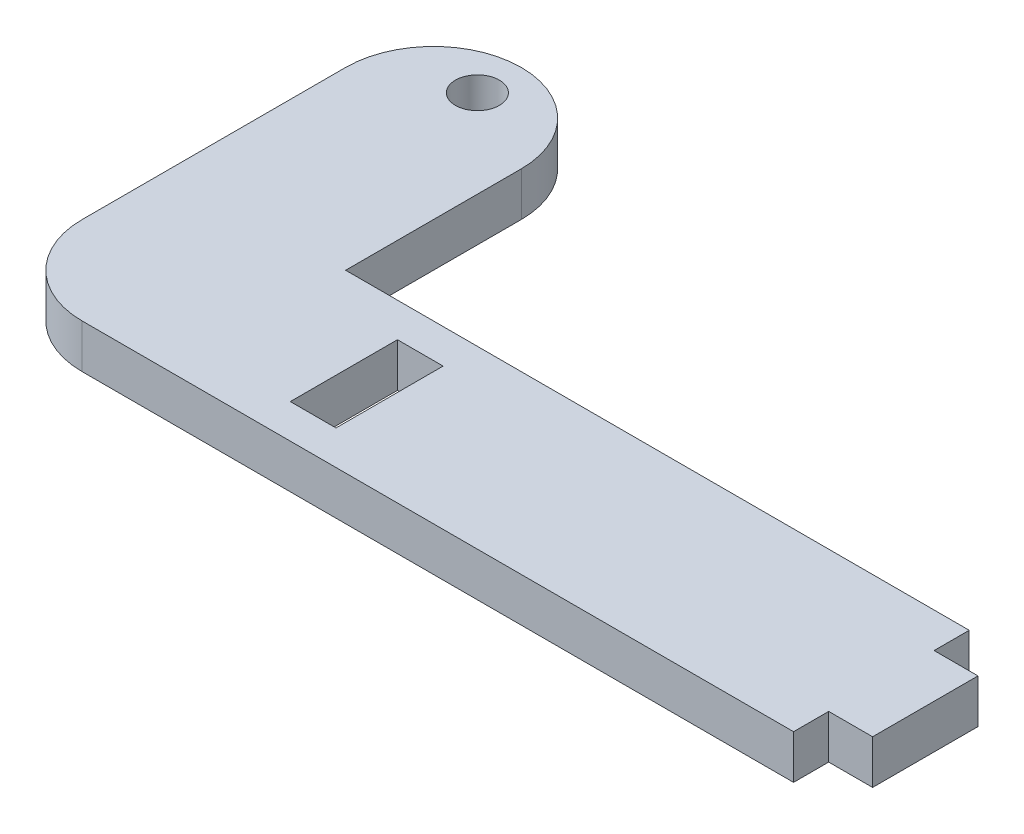
ISO-10303-21;
HEADER;
FILE_DESCRIPTION(('STEP AP214'),'2;1');
FILE_NAME('part.step','',(''),(''),'','','');
FILE_SCHEMA(('AUTOMOTIVE_DESIGN { 1 0 10303 214 1 1 1 1 }'));
ENDSEC;
DATA;
#1=APPLICATION_CONTEXT('core data for automotive mechanical design processes');
#2=APPLICATION_PROTOCOL_DEFINITION('international standard','automotive_design',2000,#1);
#3=PRODUCT_CONTEXT('',#1,'mechanical');
#4=PRODUCT('Part','Part','',(#3));
#5=PRODUCT_RELATED_PRODUCT_CATEGORY('part','',(#4));
#6=PRODUCT_DEFINITION_FORMATION('','',#4);
#7=PRODUCT_DEFINITION_CONTEXT('part definition',#1,'design');
#8=PRODUCT_DEFINITION('design','',#6,#7);
#9=PRODUCT_DEFINITION_SHAPE('','',#8);
#10=(LENGTH_UNIT() NAMED_UNIT(*) SI_UNIT(.MILLI.,.METRE.));
#11=(NAMED_UNIT(*) PLANE_ANGLE_UNIT() SI_UNIT($,.RADIAN.));
#12=(NAMED_UNIT(*) SI_UNIT($,.STERADIAN.) SOLID_ANGLE_UNIT());
#13=UNCERTAINTY_MEASURE_WITH_UNIT(LENGTH_MEASURE(1.E-05),#10,'distance_accuracy_value','');
#14=(GEOMETRIC_REPRESENTATION_CONTEXT(3) GLOBAL_UNCERTAINTY_ASSIGNED_CONTEXT((#13)) GLOBAL_UNIT_ASSIGNED_CONTEXT((#10,
#11,#12)) REPRESENTATION_CONTEXT('',''));
#15=CARTESIAN_POINT('',(0.,0.,0.));
#16=DIRECTION('',(0.,0.,1.));
#17=DIRECTION('',(1.,0.,0.));
#18=AXIS2_PLACEMENT_3D('',#15,#16,#17);
#19=CARTESIAN_POINT('',(-24.13,3.175,0.));
#20=DIRECTION('',(0.,1.,0.));
#21=DIRECTION('',(0.,0.,1.));
#22=AXIS2_PLACEMENT_3D('',#19,#20,#21);
#23=CYLINDRICAL_SURFACE('',#22,6.35);
#24=DIRECTION('',(0.,1.,0.));
#25=VECTOR('',#24,1.);
#26=CARTESIAN_POINT('',(-30.48,3.175,0.));
#27=LINE('',#26,#25);
#28=CARTESIAN_POINT('',(-30.48,0.,0.));
#29=VERTEX_POINT('',#28);
#30=CARTESIAN_POINT('',(-30.48,3.175,0.));
#31=VERTEX_POINT('',#30);
#32=EDGE_CURVE('E273',#29,#31,#27,.T.);
#33=ORIENTED_EDGE('',*,*,#32,.F.);
#34=CARTESIAN_POINT('',(-24.13,0.,0.));
#35=DIRECTION('',(0.,-1.,0.));
#36=DIRECTION('',(0.,0.,-1.));
#37=AXIS2_PLACEMENT_3D('',#34,#35,#36);
#38=CIRCLE('',#37,6.35);
#39=CARTESIAN_POINT('',(-24.13,0.,6.35));
#40=VERTEX_POINT('',#39);
#41=EDGE_CURVE('E40',#40,#29,#38,.T.);
#42=ORIENTED_EDGE('',*,*,#41,.F.);
#43=DIRECTION('',(0.,1.,0.));
#44=VECTOR('',#43,1.);
#45=CARTESIAN_POINT('',(-24.13,3.175,6.35));
#46=LINE('',#45,#44);
#47=CARTESIAN_POINT('',(-24.13,3.175,6.35));
#48=VERTEX_POINT('',#47);
#49=EDGE_CURVE('E276',#48,#40,#46,.F.);
#50=ORIENTED_EDGE('',*,*,#49,.F.);
#51=CARTESIAN_POINT('',(-24.13,3.175,0.));
#52=DIRECTION('',(0.,-1.,0.));
#53=DIRECTION('',(0.,0.,-1.));
#54=AXIS2_PLACEMENT_3D('',#51,#52,#53);
#55=CIRCLE('',#54,6.35);
#56=EDGE_CURVE('E11',#31,#48,#55,.F.);
#57=ORIENTED_EDGE('',*,*,#56,.F.);
#58=EDGE_LOOP('',(#33,#42,#50,#57));
#59=FACE_BOUND('',#58,.T.);
#60=ADVANCED_FACE('F33',(#59),#23,.T.);
#61=CARTESIAN_POINT('',(-24.13,3.175,-19.05));
#62=DIRECTION('',(0.,-1.,0.));
#63=DIRECTION('',(0.,0.,-1.));
#64=AXIS2_PLACEMENT_3D('',#61,#62,#63);
#65=CYLINDRICAL_SURFACE('',#64,6.35);
#66=DIRECTION('',(0.,1.,0.));
#67=VECTOR('',#66,1.);
#68=CARTESIAN_POINT('',(-24.13,3.175,-25.4));
#69=LINE('',#68,#67);
#70=CARTESIAN_POINT('',(-24.13,0.,-25.4));
#71=VERTEX_POINT('',#70);
#72=CARTESIAN_POINT('',(-24.13,3.175,-25.4));
#73=VERTEX_POINT('',#72);
#74=EDGE_CURVE('E255',#71,#73,#69,.T.);
#75=ORIENTED_EDGE('',*,*,#74,.T.);
#76=CARTESIAN_POINT('',(-24.13,3.175,-19.05));
#77=DIRECTION('',(0.,-1.,0.));
#78=DIRECTION('',(0.,0.,-1.));
#79=AXIS2_PLACEMENT_3D('',#76,#77,#78);
#80=CIRCLE('',#79,6.35);
#81=CARTESIAN_POINT('',(-17.78,3.175,-19.05));
#82=VERTEX_POINT('',#81);
#83=EDGE_CURVE('E269',#82,#73,#80,.F.);
#84=ORIENTED_EDGE('',*,*,#83,.F.);
#85=DIRECTION('',(0.,-1.,0.));
#86=VECTOR('',#85,1.);
#87=CARTESIAN_POINT('',(-17.78,3.175,-19.05));
#88=LINE('',#87,#86);
#89=CARTESIAN_POINT('',(-17.78,0.,-19.05));
#90=VERTEX_POINT('',#89);
#91=EDGE_CURVE('E266',#90,#82,#88,.F.);
#92=ORIENTED_EDGE('',*,*,#91,.F.);
#93=CARTESIAN_POINT('',(-24.13,0.,-19.05));
#94=DIRECTION('',(0.,-1.,0.));
#95=DIRECTION('',(0.,0.,-1.));
#96=AXIS2_PLACEMENT_3D('',#93,#94,#95);
#97=CIRCLE('',#96,6.35);
#98=EDGE_CURVE('E271',#71,#90,#97,.T.);
#99=ORIENTED_EDGE('',*,*,#98,.F.);
#100=EDGE_LOOP('',(#75,#84,#92,#99));
#101=FACE_BOUND('',#100,.T.);
#102=ADVANCED_FACE('F290',(#101),#65,.T.);
#103=CARTESIAN_POINT('',(-24.13,3.175,-19.05));
#104=DIRECTION('',(0.,1.,0.));
#105=DIRECTION('',(0.,0.,1.));
#106=AXIS2_PLACEMENT_3D('',#103,#104,#105);
#107=CYLINDRICAL_SURFACE('',#106,6.35);
#108=ORIENTED_EDGE('',*,*,#74,.F.);
#109=CARTESIAN_POINT('',(-24.13,0.,-19.05));
#110=DIRECTION('',(0.,-1.,0.));
#111=DIRECTION('',(0.,0.,-1.));
#112=AXIS2_PLACEMENT_3D('',#109,#110,#111);
#113=CIRCLE('',#112,6.35);
#114=CARTESIAN_POINT('',(-30.48,0.,-19.05));
#115=VERTEX_POINT('',#114);
#116=EDGE_CURVE('E261',#115,#71,#113,.T.);
#117=ORIENTED_EDGE('',*,*,#116,.F.);
#118=DIRECTION('',(0.,1.,0.));
#119=VECTOR('',#118,1.);
#120=CARTESIAN_POINT('',(-30.48,3.175,-19.05));
#121=LINE('',#120,#119);
#122=CARTESIAN_POINT('',(-30.48,3.175,-19.05));
#123=VERTEX_POINT('',#122);
#124=EDGE_CURVE('E258',#123,#115,#121,.F.);
#125=ORIENTED_EDGE('',*,*,#124,.F.);
#126=CARTESIAN_POINT('',(-24.13,3.175,-19.05));
#127=DIRECTION('',(0.,-1.,0.));
#128=DIRECTION('',(0.,0.,-1.));
#129=AXIS2_PLACEMENT_3D('',#126,#127,#128);
#130=CIRCLE('',#129,6.35);
#131=EDGE_CURVE('E264',#73,#123,#130,.F.);
#132=ORIENTED_EDGE('',*,*,#131,.F.);
#133=EDGE_LOOP('',(#108,#117,#125,#132));
#134=FACE_BOUND('',#133,.T.);
#135=ADVANCED_FACE('F285',(#134),#107,.T.);
#136=CARTESIAN_POINT('',(0.,3.175,0.));
#137=DIRECTION('',(0.,-1.,0.));
#138=DIRECTION('',(0.,0.,-1.));
#139=AXIS2_PLACEMENT_3D('',#136,#137,#138);
#140=PLANE('',#139);
#141=CARTESIAN_POINT('',(-24.13,3.175,-22.225));
#142=DIRECTION('',(0.,1.,0.));
#143=DIRECTION('',(0.,0.,1.));
#144=AXIS2_PLACEMENT_3D('',#141,#142,#143);
#145=CIRCLE('',#144,1.5875);
#146=CARTESIAN_POINT('',(-24.13,3.175,-20.6375));
#147=VERTEX_POINT('',#146);
#148=EDGE_CURVE('E225',#147,#147,#145,.T.);
#149=ORIENTED_EDGE('',*,*,#148,.F.);
#150=EDGE_LOOP('',(#149));
#151=FACE_BOUND('',#150,.T.);
#152=DIRECTION('',(0.,0.,1.));
#153=VECTOR('',#152,1.);
#154=CARTESIAN_POINT('',(-30.48,3.175,-6.35));
#155=LINE('',#154,#153);
#156=EDGE_CURVE('E231',#123,#31,#155,.T.);
#157=ORIENTED_EDGE('',*,*,#156,.T.);
#158=ORIENTED_EDGE('',*,*,#56,.T.);
#159=DIRECTION('',(1.,0.,0.));
#160=VECTOR('',#159,1.);
#161=CARTESIAN_POINT('',(-30.48,3.175,6.35));
#162=LINE('',#161,#160);
#163=CARTESIAN_POINT('',(27.305,3.175,6.35));
#164=VERTEX_POINT('',#163);
#165=EDGE_CURVE('E233',#48,#164,#162,.T.);
#166=ORIENTED_EDGE('',*,*,#165,.T.);
#167=DIRECTION('',(0.,0.,1.));
#168=VECTOR('',#167,1.);
#169=CARTESIAN_POINT('',(27.305,3.175,6.35));
#170=LINE('',#169,#168);
#171=CARTESIAN_POINT('',(27.305,3.175,3.81));
#172=VERTEX_POINT('',#171);
#173=EDGE_CURVE('E168',#172,#164,#170,.T.);
#174=ORIENTED_EDGE('',*,*,#173,.F.);
#175=DIRECTION('',(-1.,0.,0.));
#176=VECTOR('',#175,1.);
#177=CARTESIAN_POINT('',(30.48,3.175,3.81));
#178=LINE('',#177,#176);
#179=CARTESIAN_POINT('',(30.48,3.175,3.81));
#180=VERTEX_POINT('',#179);
#181=EDGE_CURVE('E148',#180,#172,#178,.T.);
#182=ORIENTED_EDGE('',*,*,#181,.F.);
#183=DIRECTION('',(0.,0.,-1.));
#184=VECTOR('',#183,1.);
#185=CARTESIAN_POINT('',(30.48,3.175,-6.35));
#186=LINE('',#185,#184);
#187=CARTESIAN_POINT('',(30.48,3.175,-3.81));
#188=VERTEX_POINT('',#187);
#189=EDGE_CURVE('E236',#180,#188,#186,.T.);
#190=ORIENTED_EDGE('',*,*,#189,.T.);
#191=DIRECTION('',(1.,0.,0.));
#192=VECTOR('',#191,1.);
#193=CARTESIAN_POINT('',(30.48,3.175,-3.81));
#194=LINE('',#193,#192);
#195=CARTESIAN_POINT('',(27.305,3.175,-3.81));
#196=VERTEX_POINT('',#195);
#197=EDGE_CURVE('E180',#196,#188,#194,.T.);
#198=ORIENTED_EDGE('',*,*,#197,.F.);
#199=DIRECTION('',(0.,0.,1.));
#200=VECTOR('',#199,1.);
#201=CARTESIAN_POINT('',(27.305,3.175,-6.35));
#202=LINE('',#201,#200);
#203=CARTESIAN_POINT('',(27.305,3.175,-6.35));
#204=VERTEX_POINT('',#203);
#205=EDGE_CURVE('E173',#204,#196,#202,.T.);
#206=ORIENTED_EDGE('',*,*,#205,.F.);
#207=DIRECTION('',(-1.,0.,0.));
#208=VECTOR('',#207,1.);
#209=CARTESIAN_POINT('',(30.48,3.175,-6.35));
#210=LINE('',#209,#208);
#211=CARTESIAN_POINT('',(-17.78,3.175,-6.35));
#212=VERTEX_POINT('',#211);
#213=EDGE_CURVE('E238',#204,#212,#210,.T.);
#214=ORIENTED_EDGE('',*,*,#213,.T.);
#215=DIRECTION('',(0.,0.,-1.));
#216=VECTOR('',#215,1.);
#217=CARTESIAN_POINT('',(-17.78,3.175,-6.35));
#218=LINE('',#217,#216);
#219=EDGE_CURVE('E240',#212,#82,#218,.T.);
#220=ORIENTED_EDGE('',*,*,#219,.T.);
#221=ORIENTED_EDGE('',*,*,#83,.T.);
#222=ORIENTED_EDGE('',*,*,#131,.T.);
#223=EDGE_LOOP('',(#157,#158,#166,#174,#182,#190,#198,#206,#214,#220,#221,#222));
#224=FACE_BOUND('',#223,.T.);
#225=DIRECTION('',(0.,0.,1.));
#226=VECTOR('',#225,1.);
#227=CARTESIAN_POINT('',(-11.557,3.175,-3.8735));
#228=LINE('',#227,#226);
#229=CARTESIAN_POINT('',(-11.557,3.175,-3.8735));
#230=VERTEX_POINT('',#229);
#231=CARTESIAN_POINT('',(-11.557,3.175,3.8735));
#232=VERTEX_POINT('',#231);
#233=EDGE_CURVE('E194',#230,#232,#228,.T.);
#234=ORIENTED_EDGE('',*,*,#233,.F.);
#235=DIRECTION('',(-1.,0.,0.));
#236=VECTOR('',#235,1.);
#237=CARTESIAN_POINT('',(-11.557,3.175,-3.8735));
#238=LINE('',#237,#236);
#239=CARTESIAN_POINT('',(-8.255,3.175,-3.8735));
#240=VERTEX_POINT('',#239);
#241=EDGE_CURVE('E202',#240,#230,#238,.T.);
#242=ORIENTED_EDGE('',*,*,#241,.F.);
#243=DIRECTION('',(0.,0.,-1.));
#244=VECTOR('',#243,1.);
#245=CARTESIAN_POINT('',(-8.255,3.175,-3.8735));
#246=LINE('',#245,#244);
#247=CARTESIAN_POINT('',(-8.255,3.175,3.8735));
#248=VERTEX_POINT('',#247);
#249=EDGE_CURVE('E199',#248,#240,#246,.T.);
#250=ORIENTED_EDGE('',*,*,#249,.F.);
#251=DIRECTION('',(1.,0.,0.));
#252=VECTOR('',#251,1.);
#253=CARTESIAN_POINT('',(-11.557,3.175,3.8735));
#254=LINE('',#253,#252);
#255=EDGE_CURVE('E196',#232,#248,#254,.T.);
#256=ORIENTED_EDGE('',*,*,#255,.F.);
#257=EDGE_LOOP('',(#234,#242,#250,#256));
#258=FACE_BOUND('',#257,.T.);
#259=ADVANCED_FACE('F310',(#151,#224,#258),#140,.F.);
#260=CARTESIAN_POINT('',(0.,0.,0.));
#261=DIRECTION('',(0.,-1.,0.));
#262=DIRECTION('',(0.,0.,-1.));
#263=AXIS2_PLACEMENT_3D('',#260,#261,#262);
#264=PLANE('',#263);
#265=DIRECTION('',(1.,0.,0.));
#266=VECTOR('',#265,1.);
#267=CARTESIAN_POINT('',(-30.48,0.,6.35));
#268=LINE('',#267,#266);
#269=CARTESIAN_POINT('',(27.305,0.,6.35));
#270=VERTEX_POINT('',#269);
#271=EDGE_CURVE('E246',#40,#270,#268,.T.);
#272=ORIENTED_EDGE('',*,*,#271,.F.);
#273=ORIENTED_EDGE('',*,*,#41,.T.);
#274=DIRECTION('',(0.,0.,1.));
#275=VECTOR('',#274,1.);
#276=CARTESIAN_POINT('',(-30.48,0.,-6.35));
#277=LINE('',#276,#275);
#278=EDGE_CURVE('E228',#115,#29,#277,.T.);
#279=ORIENTED_EDGE('',*,*,#278,.F.);
#280=ORIENTED_EDGE('',*,*,#116,.T.);
#281=ORIENTED_EDGE('',*,*,#98,.T.);
#282=DIRECTION('',(0.,0.,-1.));
#283=VECTOR('',#282,1.);
#284=CARTESIAN_POINT('',(-17.78,0.,-6.35));
#285=LINE('',#284,#283);
#286=CARTESIAN_POINT('',(-17.78,0.,-6.35));
#287=VERTEX_POINT('',#286);
#288=EDGE_CURVE('E234',#287,#90,#285,.T.);
#289=ORIENTED_EDGE('',*,*,#288,.F.);
#290=DIRECTION('',(-1.,0.,0.));
#291=VECTOR('',#290,1.);
#292=CARTESIAN_POINT('',(30.48,0.,-6.35));
#293=LINE('',#292,#291);
#294=CARTESIAN_POINT('',(27.305,0.,-6.35));
#295=VERTEX_POINT('',#294);
#296=EDGE_CURVE('E249',#295,#287,#293,.T.);
#297=ORIENTED_EDGE('',*,*,#296,.F.);
#298=DIRECTION('',(0.,0.,1.));
#299=VECTOR('',#298,1.);
#300=CARTESIAN_POINT('',(27.305,0.,-6.35));
#301=LINE('',#300,#299);
#302=CARTESIAN_POINT('',(27.305,0.,-3.81));
#303=VERTEX_POINT('',#302);
#304=EDGE_CURVE('E176',#295,#303,#301,.T.);
#305=ORIENTED_EDGE('',*,*,#304,.T.);
#306=DIRECTION('',(1.,0.,0.));
#307=VECTOR('',#306,1.);
#308=CARTESIAN_POINT('',(30.48,0.,-3.81));
#309=LINE('',#308,#307);
#310=CARTESIAN_POINT('',(30.48,0.,-3.81));
#311=VERTEX_POINT('',#310);
#312=EDGE_CURVE('E179',#303,#311,#309,.T.);
#313=ORIENTED_EDGE('',*,*,#312,.T.);
#314=DIRECTION('',(0.,0.,-1.));
#315=VECTOR('',#314,1.);
#316=CARTESIAN_POINT('',(30.48,0.,-6.35));
#317=LINE('',#316,#315);
#318=CARTESIAN_POINT('',(30.48,0.,3.81));
#319=VERTEX_POINT('',#318);
#320=EDGE_CURVE('E167',#319,#311,#317,.T.);
#321=ORIENTED_EDGE('',*,*,#320,.F.);
#322=DIRECTION('',(-1.,0.,0.));
#323=VECTOR('',#322,1.);
#324=CARTESIAN_POINT('',(30.48,0.,3.81));
#325=LINE('',#324,#323);
#326=CARTESIAN_POINT('',(27.305,0.,3.81));
#327=VERTEX_POINT('',#326);
#328=EDGE_CURVE('E145',#319,#327,#325,.T.);
#329=ORIENTED_EDGE('',*,*,#328,.T.);
#330=DIRECTION('',(0.,0.,1.));
#331=VECTOR('',#330,1.);
#332=CARTESIAN_POINT('',(27.305,0.,6.35));
#333=LINE('',#332,#331);
#334=EDGE_CURVE('E157',#327,#270,#333,.T.);
#335=ORIENTED_EDGE('',*,*,#334,.T.);
#336=EDGE_LOOP('',(#272,#273,#279,#280,#281,#289,#297,#305,#313,#321,#329,#335));
#337=FACE_BOUND('',#336,.T.);
#338=CARTESIAN_POINT('',(-24.13,0.,-22.225));
#339=DIRECTION('',(0.,1.,0.));
#340=DIRECTION('',(0.,0.,1.));
#341=AXIS2_PLACEMENT_3D('',#338,#339,#340);
#342=CIRCLE('',#341,1.5875);
#343=CARTESIAN_POINT('',(-24.13,0.,-20.6375));
#344=VERTEX_POINT('',#343);
#345=EDGE_CURVE('E224',#344,#344,#342,.T.);
#346=ORIENTED_EDGE('',*,*,#345,.T.);
#347=EDGE_LOOP('',(#346));
#348=FACE_BOUND('',#347,.T.);
#349=DIRECTION('',(-1.,0.,0.));
#350=VECTOR('',#349,1.);
#351=CARTESIAN_POINT('',(-11.557,0.,-3.8735));
#352=LINE('',#351,#350);
#353=CARTESIAN_POINT('',(-8.255,0.,-3.8735));
#354=VERTEX_POINT('',#353);
#355=CARTESIAN_POINT('',(-11.557,0.,-3.8735));
#356=VERTEX_POINT('',#355);
#357=EDGE_CURVE('E197',#354,#356,#352,.T.);
#358=ORIENTED_EDGE('',*,*,#357,.T.);
#359=DIRECTION('',(0.,0.,1.));
#360=VECTOR('',#359,1.);
#361=CARTESIAN_POINT('',(-11.557,0.,-3.8735));
#362=LINE('',#361,#360);
#363=CARTESIAN_POINT('',(-11.557,0.,3.8735));
#364=VERTEX_POINT('',#363);
#365=EDGE_CURVE('E190',#356,#364,#362,.T.);
#366=ORIENTED_EDGE('',*,*,#365,.T.);
#367=DIRECTION('',(1.,0.,0.));
#368=VECTOR('',#367,1.);
#369=CARTESIAN_POINT('',(-11.557,0.,3.8735));
#370=LINE('',#369,#368);
#371=CARTESIAN_POINT('',(-8.255,0.,3.8735));
#372=VERTEX_POINT('',#371);
#373=EDGE_CURVE('E207',#364,#372,#370,.T.);
#374=ORIENTED_EDGE('',*,*,#373,.T.);
#375=DIRECTION('',(0.,0.,-1.));
#376=VECTOR('',#375,1.);
#377=CARTESIAN_POINT('',(-8.255,0.,-3.8735));
#378=LINE('',#377,#376);
#379=EDGE_CURVE('E210',#372,#354,#378,.T.);
#380=ORIENTED_EDGE('',*,*,#379,.T.);
#381=EDGE_LOOP('',(#358,#366,#374,#380));
#382=FACE_BOUND('',#381,.T.);
#383=ADVANCED_FACE('F164',(#337,#348,#382),#264,.T.);
#384=CARTESIAN_POINT('',(-30.48,3.175,-6.35));
#385=DIRECTION('',(1.,0.,0.));
#386=DIRECTION('',(0.,0.,-1.));
#387=AXIS2_PLACEMENT_3D('',#384,#385,#386);
#388=PLANE('',#387);
#389=ORIENTED_EDGE('',*,*,#278,.T.);
#390=ORIENTED_EDGE('',*,*,#32,.T.);
#391=ORIENTED_EDGE('',*,*,#156,.F.);
#392=ORIENTED_EDGE('',*,*,#124,.T.);
#393=EDGE_LOOP('',(#389,#390,#391,#392));
#394=FACE_BOUND('',#393,.T.);
#395=ADVANCED_FACE('F280',(#394),#388,.F.);
#396=CARTESIAN_POINT('',(-30.48,3.175,6.35));
#397=DIRECTION('',(0.,0.,-1.));
#398=DIRECTION('',(-1.,0.,0.));
#399=AXIS2_PLACEMENT_3D('',#396,#397,#398);
#400=PLANE('',#399);
#401=ORIENTED_EDGE('',*,*,#165,.F.);
#402=ORIENTED_EDGE('',*,*,#49,.T.);
#403=ORIENTED_EDGE('',*,*,#271,.T.);
#404=DIRECTION('',(0.,1.,0.));
#405=VECTOR('',#404,1.);
#406=CARTESIAN_POINT('',(27.305,0.,6.35));
#407=LINE('',#406,#405);
#408=EDGE_CURVE('E152',#270,#164,#407,.T.);
#409=ORIENTED_EDGE('',*,*,#408,.T.);
#410=EDGE_LOOP('',(#401,#402,#403,#409));
#411=FACE_BOUND('',#410,.T.);
#412=ADVANCED_FACE('F314',(#411),#400,.F.);
#413=CARTESIAN_POINT('',(30.48,3.175,-6.35));
#414=DIRECTION('',(-1.,0.,0.));
#415=DIRECTION('',(0.,0.,1.));
#416=AXIS2_PLACEMENT_3D('',#413,#414,#415);
#417=PLANE('',#416);
#418=ORIENTED_EDGE('',*,*,#189,.F.);
#419=DIRECTION('',(0.,1.,0.));
#420=VECTOR('',#419,1.);
#421=CARTESIAN_POINT('',(30.48,0.,3.81));
#422=LINE('',#421,#420);
#423=EDGE_CURVE('E153',#319,#180,#422,.T.);
#424=ORIENTED_EDGE('',*,*,#423,.F.);
#425=ORIENTED_EDGE('',*,*,#320,.T.);
#426=DIRECTION('',(0.,1.,0.));
#427=VECTOR('',#426,1.);
#428=CARTESIAN_POINT('',(30.48,0.,-3.81));
#429=LINE('',#428,#427);
#430=EDGE_CURVE('E187',#311,#188,#429,.T.);
#431=ORIENTED_EDGE('',*,*,#430,.T.);
#432=EDGE_LOOP('',(#418,#424,#425,#431));
#433=FACE_BOUND('',#432,.T.);
#434=ADVANCED_FACE('F309',(#433),#417,.F.);
#435=CARTESIAN_POINT('',(30.48,3.175,-6.35));
#436=DIRECTION('',(0.,0.,1.));
#437=DIRECTION('',(1.,0.,0.));
#438=AXIS2_PLACEMENT_3D('',#435,#436,#437);
#439=PLANE('',#438);
#440=ORIENTED_EDGE('',*,*,#213,.F.);
#441=DIRECTION('',(0.,1.,0.));
#442=VECTOR('',#441,1.);
#443=CARTESIAN_POINT('',(27.305,0.,-6.35));
#444=LINE('',#443,#442);
#445=EDGE_CURVE('E182',#295,#204,#444,.T.);
#446=ORIENTED_EDGE('',*,*,#445,.F.);
#447=ORIENTED_EDGE('',*,*,#296,.T.);
#448=DIRECTION('',(0.,-1.,0.));
#449=VECTOR('',#448,1.);
#450=CARTESIAN_POINT('',(-17.78,3.175,-6.35));
#451=LINE('',#450,#449);
#452=EDGE_CURVE('E243',#212,#287,#451,.T.);
#453=ORIENTED_EDGE('',*,*,#452,.F.);
#454=EDGE_LOOP('',(#440,#446,#447,#453));
#455=FACE_BOUND('',#454,.T.);
#456=ADVANCED_FACE('F297',(#455),#439,.F.);
#457=CARTESIAN_POINT('',(-17.78,3.175,-6.35));
#458=DIRECTION('',(-1.,0.,0.));
#459=DIRECTION('',(0.,0.,1.));
#460=AXIS2_PLACEMENT_3D('',#457,#458,#459);
#461=PLANE('',#460);
#462=ORIENTED_EDGE('',*,*,#288,.T.);
#463=ORIENTED_EDGE('',*,*,#91,.T.);
#464=ORIENTED_EDGE('',*,*,#219,.F.);
#465=ORIENTED_EDGE('',*,*,#452,.T.);
#466=EDGE_LOOP('',(#462,#463,#464,#465));
#467=FACE_BOUND('',#466,.T.);
#468=ADVANCED_FACE('F293',(#467),#461,.F.);
#469=CARTESIAN_POINT('',(-24.13,3.175,-22.225));
#470=DIRECTION('',(0.,-1.,0.));
#471=DIRECTION('',(0.,0.,-1.));
#472=AXIS2_PLACEMENT_3D('',#469,#470,#471);
#473=CYLINDRICAL_SURFACE('',#472,1.5875);
#474=ORIENTED_EDGE('',*,*,#148,.T.);
#475=EDGE_LOOP('',(#474));
#476=FACE_BOUND('',#475,.T.);
#477=ORIENTED_EDGE('',*,*,#345,.F.);
#478=EDGE_LOOP('',(#477));
#479=FACE_BOUND('',#478,.T.);
#480=ADVANCED_FACE('F342',(#476,#479),#473,.F.);
#481=CARTESIAN_POINT('',(-11.557,3.175,-3.8735));
#482=DIRECTION('',(1.,0.,0.));
#483=DIRECTION('',(0.,0.,-1.));
#484=AXIS2_PLACEMENT_3D('',#481,#482,#483);
#485=PLANE('',#484);
#486=ORIENTED_EDGE('',*,*,#365,.F.);
#487=DIRECTION('',(0.,-1.,0.));
#488=VECTOR('',#487,1.);
#489=CARTESIAN_POINT('',(-11.557,3.175,-3.8735));
#490=LINE('',#489,#488);
#491=EDGE_CURVE('E204',#230,#356,#490,.T.);
#492=ORIENTED_EDGE('',*,*,#491,.F.);
#493=ORIENTED_EDGE('',*,*,#233,.T.);
#494=DIRECTION('',(0.,-1.,0.));
#495=VECTOR('',#494,1.);
#496=CARTESIAN_POINT('',(-11.557,3.175,3.8735));
#497=LINE('',#496,#495);
#498=EDGE_CURVE('E221',#232,#364,#497,.T.);
#499=ORIENTED_EDGE('',*,*,#498,.T.);
#500=EDGE_LOOP('',(#486,#492,#493,#499));
#501=FACE_BOUND('',#500,.T.);
#502=ADVANCED_FACE('F363',(#501),#485,.T.);
#503=CARTESIAN_POINT('',(-11.557,3.175,3.8735));
#504=DIRECTION('',(0.,0.,-1.));
#505=DIRECTION('',(-1.,0.,0.));
#506=AXIS2_PLACEMENT_3D('',#503,#504,#505);
#507=PLANE('',#506);
#508=ORIENTED_EDGE('',*,*,#373,.F.);
#509=ORIENTED_EDGE('',*,*,#498,.F.);
#510=ORIENTED_EDGE('',*,*,#255,.T.);
#511=DIRECTION('',(0.,-1.,0.));
#512=VECTOR('',#511,1.);
#513=CARTESIAN_POINT('',(-8.255,3.175,3.8735));
#514=LINE('',#513,#512);
#515=EDGE_CURVE('E219',#248,#372,#514,.T.);
#516=ORIENTED_EDGE('',*,*,#515,.T.);
#517=EDGE_LOOP('',(#508,#509,#510,#516));
#518=FACE_BOUND('',#517,.T.);
#519=ADVANCED_FACE('F370',(#518),#507,.T.);
#520=CARTESIAN_POINT('',(-8.255,3.175,-3.8735));
#521=DIRECTION('',(-1.,0.,0.));
#522=DIRECTION('',(0.,0.,1.));
#523=AXIS2_PLACEMENT_3D('',#520,#521,#522);
#524=PLANE('',#523);
#525=ORIENTED_EDGE('',*,*,#379,.F.);
#526=ORIENTED_EDGE('',*,*,#515,.F.);
#527=ORIENTED_EDGE('',*,*,#249,.T.);
#528=DIRECTION('',(0.,-1.,0.));
#529=VECTOR('',#528,1.);
#530=CARTESIAN_POINT('',(-8.255,3.175,-3.8735));
#531=LINE('',#530,#529);
#532=EDGE_CURVE('E217',#240,#354,#531,.T.);
#533=ORIENTED_EDGE('',*,*,#532,.T.);
#534=EDGE_LOOP('',(#525,#526,#527,#533));
#535=FACE_BOUND('',#534,.T.);
#536=ADVANCED_FACE('F377',(#535),#524,.T.);
#537=CARTESIAN_POINT('',(-11.557,3.175,-3.8735));
#538=DIRECTION('',(0.,0.,1.));
#539=DIRECTION('',(1.,0.,0.));
#540=AXIS2_PLACEMENT_3D('',#537,#538,#539);
#541=PLANE('',#540);
#542=ORIENTED_EDGE('',*,*,#357,.F.);
#543=ORIENTED_EDGE('',*,*,#532,.F.);
#544=ORIENTED_EDGE('',*,*,#241,.T.);
#545=ORIENTED_EDGE('',*,*,#491,.T.);
#546=EDGE_LOOP('',(#542,#543,#544,#545));
#547=FACE_BOUND('',#546,.T.);
#548=ADVANCED_FACE('F385',(#547),#541,.T.);
#549=CARTESIAN_POINT('',(30.48,0.,-3.81));
#550=DIRECTION('',(0.,0.,1.));
#551=DIRECTION('',(1.,0.,0.));
#552=AXIS2_PLACEMENT_3D('',#549,#550,#551);
#553=PLANE('',#552);
#554=ORIENTED_EDGE('',*,*,#197,.T.);
#555=ORIENTED_EDGE('',*,*,#430,.F.);
#556=ORIENTED_EDGE('',*,*,#312,.F.);
#557=DIRECTION('',(0.,1.,0.));
#558=VECTOR('',#557,1.);
#559=CARTESIAN_POINT('',(27.305,0.,-3.81));
#560=LINE('',#559,#558);
#561=EDGE_CURVE('E191',#303,#196,#560,.T.);
#562=ORIENTED_EDGE('',*,*,#561,.T.);
#563=EDGE_LOOP('',(#554,#555,#556,#562));
#564=FACE_BOUND('',#563,.T.);
#565=ADVANCED_FACE('F306',(#564),#553,.F.);
#566=CARTESIAN_POINT('',(27.305,0.,-6.35));
#567=DIRECTION('',(-1.,0.,0.));
#568=DIRECTION('',(0.,0.,1.));
#569=AXIS2_PLACEMENT_3D('',#566,#567,#568);
#570=PLANE('',#569);
#571=ORIENTED_EDGE('',*,*,#205,.T.);
#572=ORIENTED_EDGE('',*,*,#561,.F.);
#573=ORIENTED_EDGE('',*,*,#304,.F.);
#574=ORIENTED_EDGE('',*,*,#445,.T.);
#575=EDGE_LOOP('',(#571,#572,#573,#574));
#576=FACE_BOUND('',#575,.T.);
#577=ADVANCED_FACE('F301',(#576),#570,.F.);
#578=CARTESIAN_POINT('',(27.305,0.,6.35));
#579=DIRECTION('',(-1.,0.,0.));
#580=DIRECTION('',(0.,0.,1.));
#581=AXIS2_PLACEMENT_3D('',#578,#579,#580);
#582=PLANE('',#581);
#583=ORIENTED_EDGE('',*,*,#173,.T.);
#584=ORIENTED_EDGE('',*,*,#408,.F.);
#585=ORIENTED_EDGE('',*,*,#334,.F.);
#586=DIRECTION('',(0.,1.,0.));
#587=VECTOR('',#586,1.);
#588=CARTESIAN_POINT('',(27.305,0.,3.81));
#589=LINE('',#588,#587);
#590=EDGE_CURVE('E141',#327,#172,#589,.T.);
#591=ORIENTED_EDGE('',*,*,#590,.T.);
#592=EDGE_LOOP('',(#583,#584,#585,#591));
#593=FACE_BOUND('',#592,.T.);
#594=ADVANCED_FACE('F158',(#593),#582,.F.);
#595=CARTESIAN_POINT('',(30.48,0.,3.81));
#596=DIRECTION('',(0.,0.,-1.));
#597=DIRECTION('',(-1.,0.,0.));
#598=AXIS2_PLACEMENT_3D('',#595,#596,#597);
#599=PLANE('',#598);
#600=ORIENTED_EDGE('',*,*,#181,.T.);
#601=ORIENTED_EDGE('',*,*,#590,.F.);
#602=ORIENTED_EDGE('',*,*,#328,.F.);
#603=ORIENTED_EDGE('',*,*,#423,.T.);
#604=EDGE_LOOP('',(#600,#601,#602,#603));
#605=FACE_BOUND('',#604,.T.);
#606=ADVANCED_FACE('F143',(#605),#599,.F.);
#607=CLOSED_SHELL('',(#60,#102,#135,#259,#383,#395,#412,#434,#456,#468,#480,#502,#519,#536,#548,
#565,#577,#594,#606));
#608=MANIFOLD_SOLID_BREP('B2',#607);
#609=ADVANCED_BREP_SHAPE_REPRESENTATION('',(#18,#608),#14);
#610=SHAPE_DEFINITION_REPRESENTATION(#9,#609);
ENDSEC;
END-ISO-10303-21;
